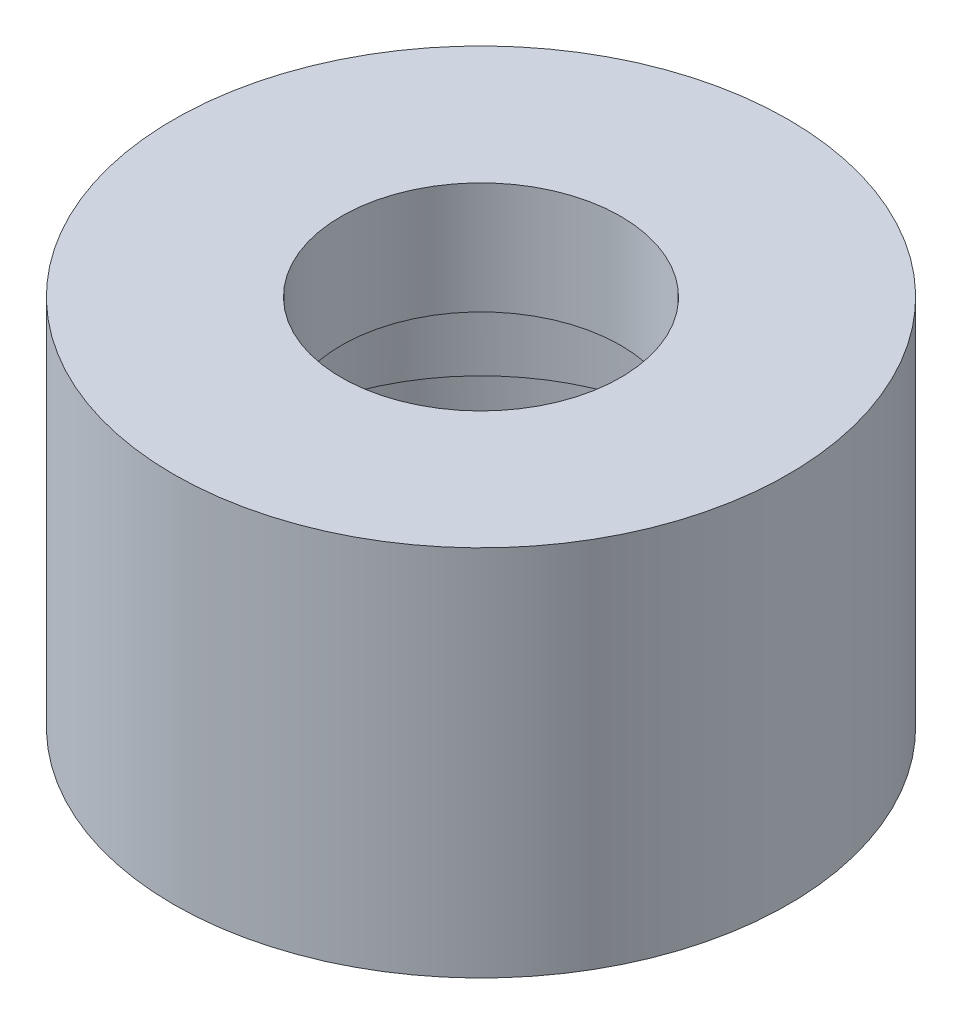
ISO-10303-21;
HEADER;
FILE_DESCRIPTION(('STEP AP214'),'2;1');
FILE_NAME('part.step','',(''),(''),'','','');
FILE_SCHEMA(('AUTOMOTIVE_DESIGN { 1 0 10303 214 1 1 1 1 }'));
ENDSEC;
DATA;
#1=APPLICATION_CONTEXT('core data for automotive mechanical design processes');
#2=APPLICATION_PROTOCOL_DEFINITION('international standard','automotive_design',2000,#1);
#3=PRODUCT_CONTEXT('',#1,'mechanical');
#4=PRODUCT('Part','Part','',(#3));
#5=PRODUCT_RELATED_PRODUCT_CATEGORY('part','',(#4));
#6=PRODUCT_DEFINITION_FORMATION('','',#4);
#7=PRODUCT_DEFINITION_CONTEXT('part definition',#1,'design');
#8=PRODUCT_DEFINITION('design','',#6,#7);
#9=PRODUCT_DEFINITION_SHAPE('','',#8);
#10=(LENGTH_UNIT() NAMED_UNIT(*) SI_UNIT(.MILLI.,.METRE.));
#11=(NAMED_UNIT(*) PLANE_ANGLE_UNIT() SI_UNIT($,.RADIAN.));
#12=(NAMED_UNIT(*) SI_UNIT($,.STERADIAN.) SOLID_ANGLE_UNIT());
#13=UNCERTAINTY_MEASURE_WITH_UNIT(LENGTH_MEASURE(1.E-05),#10,'distance_accuracy_value','');
#14=(GEOMETRIC_REPRESENTATION_CONTEXT(3) GLOBAL_UNCERTAINTY_ASSIGNED_CONTEXT((#13)) GLOBAL_UNIT_ASSIGNED_CONTEXT((#10,
#11,#12)) REPRESENTATION_CONTEXT('',''));
#15=CARTESIAN_POINT('',(0.,0.,0.));
#16=DIRECTION('',(0.,0.,1.));
#17=DIRECTION('',(1.,0.,0.));
#18=AXIS2_PLACEMENT_3D('',#15,#16,#17);
#19=CARTESIAN_POINT('',(0.,0.,0.));
#20=DIRECTION('',(0.,1.,0.));
#21=DIRECTION('',(0.,0.,1.));
#22=AXIS2_PLACEMENT_3D('',#19,#20,#21);
#23=PLANE('',#22);
#24=CARTESIAN_POINT('',(0.,0.,0.));
#25=DIRECTION('',(0.,1.,0.));
#26=DIRECTION('',(0.,0.,1.));
#27=AXIS2_PLACEMENT_3D('',#24,#25,#26);
#28=CIRCLE('',#27,16.5);
#29=CARTESIAN_POINT('',(0.,0.,16.5));
#30=VERTEX_POINT('',#29);
#31=EDGE_CURVE('E274',#30,#30,#28,.T.);
#32=ORIENTED_EDGE('',*,*,#31,.F.);
#33=EDGE_LOOP('',(#32));
#34=FACE_BOUND('',#33,.T.);
#35=DIRECTION('',(-0.500000000000004,0.,-0.866025403784436));
#36=VECTOR('',#35,1.);
#37=CARTESIAN_POINT('',(3.03108891324553,0.,-1.75000000000001));
#38=LINE('',#37,#36);
#39=CARTESIAN_POINT('',(-2.44613666180617,0.,-11.2368329805051));
#40=VERTEX_POINT('',#39);
#41=CARTESIAN_POINT('',(-3.44613666180618,0.,-12.968883788074));
#42=VERTEX_POINT('',#41);
#43=EDGE_CURVE('E228',#40,#42,#38,.T.);
#44=ORIENTED_EDGE('',*,*,#43,.F.);
#45=CARTESIAN_POINT('',(0.,0.,0.));
#46=DIRECTION('',(0.,-1.,0.));
#47=DIRECTION('',(0.,0.,-1.));
#48=AXIS2_PLACEMENT_3D('',#45,#46,#47);
#49=CIRCLE('',#48,11.5);
#50=CARTESIAN_POINT('',(-11.0588811407401,0.,3.15454401062719));
#51=VERTEX_POINT('',#50);
#52=EDGE_CURVE('E271',#51,#40,#49,.T.);
#53=ORIENTED_EDGE('',*,*,#52,.F.);
#54=DIRECTION('',(0.499999999999992,0.,-0.866025403784443));
#55=VECTOR('',#54,1.);
#56=CARTESIAN_POINT('',(-6.92820323027555,0.,-3.99999999999994));
#57=LINE('',#56,#55);
#58=CARTESIAN_POINT('',(-12.05888114074,0.,4.88659481819608));
#59=VERTEX_POINT('',#58);
#60=EDGE_CURVE('E225',#59,#51,#57,.T.);
#61=ORIENTED_EDGE('',*,*,#60,.F.);
#62=CARTESIAN_POINT('',(-0.999999999999984,0.,1.73205080756889));
#63=DIRECTION('',(0.,1.,0.));
#64=DIRECTION('',(0.,0.,1.));
#65=AXIS2_PLACEMENT_3D('',#62,#63,#64);
#66=CIRCLE('',#65,11.5);
#67=CARTESIAN_POINT('',(-9.50831448829711,0.,9.4688837880741));
#68=VERTEX_POINT('',#67);
#69=EDGE_CURVE('E45',#59,#68,#66,.T.);
#70=ORIENTED_EDGE('',*,*,#69,.T.);
#71=DIRECTION('',(-0.499999999999992,0.,0.866025403784443));
#72=VECTOR('',#71,1.);
#73=CARTESIAN_POINT('',(-3.03108891324555,0.,-1.74999999999997));
#74=LINE('',#73,#72);
#75=CARTESIAN_POINT('',(-8.50831448829713,0.,7.73683298050521));
#76=VERTEX_POINT('',#75);
#77=EDGE_CURVE('E205',#76,#68,#74,.T.);
#78=ORIENTED_EDGE('',*,*,#77,.F.);
#79=CARTESIAN_POINT('',(8.26135582092915,0.,8.));
#80=VERTEX_POINT('',#79);
#81=EDGE_CURVE('E268',#80,#76,#49,.T.);
#82=ORIENTED_EDGE('',*,*,#81,.F.);
#83=DIRECTION('',(-1.,0.,0.));
#84=VECTOR('',#83,1.);
#85=CARTESIAN_POINT('',(0.,0.,8.));
#86=LINE('',#85,#84);
#87=CARTESIAN_POINT('',(10.2613558209292,0.,8.));
#88=VERTEX_POINT('',#87);
#89=EDGE_CURVE('E234',#88,#80,#86,.T.);
#90=ORIENTED_EDGE('',*,*,#89,.F.);
#91=CARTESIAN_POINT('',(2.,0.,0.));
#92=DIRECTION('',(0.,1.,0.));
#93=DIRECTION('',(0.,0.,1.));
#94=AXIS2_PLACEMENT_3D('',#91,#92,#93);
#95=CIRCLE('',#94,11.5);
#96=CARTESIAN_POINT('',(12.9544511501033,0.,3.5));
#97=VERTEX_POINT('',#96);
#98=EDGE_CURVE('E291',#88,#97,#95,.T.);
#99=ORIENTED_EDGE('',*,*,#98,.T.);
#100=DIRECTION('',(1.,0.,0.));
#101=VECTOR('',#100,1.);
#102=CARTESIAN_POINT('',(0.,0.,3.5));
#103=LINE('',#102,#101);
#104=CARTESIAN_POINT('',(10.9544511501033,0.,3.5));
#105=VERTEX_POINT('',#104);
#106=EDGE_CURVE('E258',#105,#97,#103,.T.);
#107=ORIENTED_EDGE('',*,*,#106,.F.);
#108=CARTESIAN_POINT('',(2.79752531981089,0.,-11.1545440106271));
#109=VERTEX_POINT('',#108);
#110=EDGE_CURVE('E263',#109,#105,#49,.T.);
#111=ORIENTED_EDGE('',*,*,#110,.F.);
#112=DIRECTION('',(0.500000000000004,0.,0.866025403784436));
#113=VECTOR('',#112,1.);
#114=CARTESIAN_POINT('',(6.92820323027549,0.,-4.00000000000003));
#115=LINE('',#114,#113);
#116=CARTESIAN_POINT('',(1.79752531981088,0.,-12.886594818196));
#117=VERTEX_POINT('',#116);
#118=EDGE_CURVE('E60',#117,#109,#115,.T.);
#119=ORIENTED_EDGE('',*,*,#118,.F.);
#120=CARTESIAN_POINT('',(-1.00000000000001,0.,-1.73205080756887));
#121=DIRECTION('',(0.,1.,0.));
#122=DIRECTION('',(0.,0.,1.));
#123=AXIS2_PLACEMENT_3D('',#120,#121,#122);
#124=CIRCLE('',#123,11.5);
#125=EDGE_CURVE('E12',#117,#42,#124,.T.);
#126=ORIENTED_EDGE('',*,*,#125,.T.);
#127=EDGE_LOOP('',(#44,#53,#61,#70,#78,#82,#90,#99,#107,#111,#119,#126));
#128=FACE_BOUND('',#127,.T.);
#129=ADVANCED_FACE('F37',(#34,#128),#23,.F.);
#130=CARTESIAN_POINT('',(0.,14.,0.));
#131=DIRECTION('',(0.,-1.,0.));
#132=DIRECTION('',(0.,0.,-1.));
#133=AXIS2_PLACEMENT_3D('',#130,#131,#132);
#134=CYLINDRICAL_SURFACE('',#133,11.5);
#135=CARTESIAN_POINT('',(0.,14.,0.));
#136=DIRECTION('',(0.,-1.,0.));
#137=DIRECTION('',(0.,0.,-1.));
#138=AXIS2_PLACEMENT_3D('',#135,#136,#137);
#139=CIRCLE('',#138,11.5);
#140=CARTESIAN_POINT('',(0.,14.,-11.5));
#141=VERTEX_POINT('',#140);
#142=EDGE_CURVE('E264',#141,#141,#139,.T.);
#143=ORIENTED_EDGE('',*,*,#142,.F.);
#144=EDGE_LOOP('',(#143));
#145=FACE_BOUND('',#144,.T.);
#146=DIRECTION('',(0.,-1.,0.));
#147=VECTOR('',#146,1.);
#148=CARTESIAN_POINT('',(-2.44613666180617,14.,-11.2368329805051));
#149=LINE('',#148,#147);
#150=CARTESIAN_POINT('',(-2.44613666180617,4.1,-11.2368329805051));
#151=VERTEX_POINT('',#150);
#152=EDGE_CURVE('E309',#151,#40,#149,.T.);
#153=ORIENTED_EDGE('',*,*,#152,.F.);
#154=CARTESIAN_POINT('',(0.,4.1,0.));
#155=DIRECTION('',(0.,1.,0.));
#156=DIRECTION('',(-1.,0.,0.));
#157=AXIS2_PLACEMENT_3D('',#154,#155,#156);
#158=CIRCLE('',#157,11.5);
#159=CARTESIAN_POINT('',(-11.0588811407401,4.1,-3.15454401062704));
#160=VERTEX_POINT('',#159);
#161=EDGE_CURVE('E302',#160,#151,#158,.F.);
#162=ORIENTED_EDGE('',*,*,#161,.F.);
#163=DIRECTION('',(0.,-1.,0.));
#164=VECTOR('',#163,1.);
#165=CARTESIAN_POINT('',(-11.0588811407401,14.,-3.15454401062704));
#166=LINE('',#165,#164);
#167=CARTESIAN_POINT('',(-11.0588811407401,8.2,-3.15454401062704));
#168=VERTEX_POINT('',#167);
#169=EDGE_CURVE('E307',#168,#160,#166,.T.);
#170=ORIENTED_EDGE('',*,*,#169,.F.);
#171=CARTESIAN_POINT('',(0.,8.2,0.));
#172=DIRECTION('',(0.,-1.,0.));
#173=DIRECTION('',(1.,0.,0.));
#174=AXIS2_PLACEMENT_3D('',#171,#172,#173);
#175=CIRCLE('',#174,11.5);
#176=CARTESIAN_POINT('',(2.79752531981089,8.2,-11.1545440106271));
#177=VERTEX_POINT('',#176);
#178=EDGE_CURVE('E299',#177,#168,#175,.F.);
#179=ORIENTED_EDGE('',*,*,#178,.F.);
#180=DIRECTION('',(0.,-1.,0.));
#181=VECTOR('',#180,1.);
#182=CARTESIAN_POINT('',(2.79752531981089,14.,-11.1545440106271));
#183=LINE('',#182,#181);
#184=EDGE_CURVE('E305',#109,#177,#183,.F.);
#185=ORIENTED_EDGE('',*,*,#184,.F.);
#186=ORIENTED_EDGE('',*,*,#110,.T.);
#187=DIRECTION('',(0.,-1.,0.));
#188=VECTOR('',#187,1.);
#189=CARTESIAN_POINT('',(10.9544511501033,14.,3.5));
#190=LINE('',#189,#188);
#191=CARTESIAN_POINT('',(10.9544511501033,4.1,3.5));
#192=VERTEX_POINT('',#191);
#193=EDGE_CURVE('E288',#192,#105,#190,.T.);
#194=ORIENTED_EDGE('',*,*,#193,.F.);
#195=CARTESIAN_POINT('',(0.,4.1,0.));
#196=DIRECTION('',(0.,1.,0.));
#197=DIRECTION('',(0.,0.,1.));
#198=AXIS2_PLACEMENT_3D('',#195,#196,#197);
#199=CIRCLE('',#198,11.5);
#200=CARTESIAN_POINT('',(8.26135582092915,4.1,-8.));
#201=VERTEX_POINT('',#200);
#202=EDGE_CURVE('E286',#201,#192,#199,.F.);
#203=ORIENTED_EDGE('',*,*,#202,.F.);
#204=DIRECTION('',(0.,-1.,0.));
#205=VECTOR('',#204,1.);
#206=CARTESIAN_POINT('',(8.26135582092915,14.,-8.));
#207=LINE('',#206,#205);
#208=CARTESIAN_POINT('',(8.26135582092915,8.2,-8.));
#209=VERTEX_POINT('',#208);
#210=EDGE_CURVE('E284',#209,#201,#207,.T.);
#211=ORIENTED_EDGE('',*,*,#210,.F.);
#212=CARTESIAN_POINT('',(0.,8.2,0.));
#213=DIRECTION('',(0.,-1.,0.));
#214=DIRECTION('',(0.,0.,-1.));
#215=AXIS2_PLACEMENT_3D('',#212,#213,#214);
#216=CIRCLE('',#215,11.5);
#217=CARTESIAN_POINT('',(8.26135582092915,8.2,8.));
#218=VERTEX_POINT('',#217);
#219=EDGE_CURVE('E282',#218,#209,#216,.F.);
#220=ORIENTED_EDGE('',*,*,#219,.F.);
#221=DIRECTION('',(0.,-1.,0.));
#222=VECTOR('',#221,1.);
#223=CARTESIAN_POINT('',(8.26135582092915,14.,8.));
#224=LINE('',#223,#222);
#225=EDGE_CURVE('E278',#80,#218,#224,.F.);
#226=ORIENTED_EDGE('',*,*,#225,.F.);
#227=ORIENTED_EDGE('',*,*,#81,.T.);
#228=DIRECTION('',(0.,-1.,0.));
#229=VECTOR('',#228,1.);
#230=CARTESIAN_POINT('',(-8.50831448829713,14.,7.73683298050521));
#231=LINE('',#230,#229);
#232=CARTESIAN_POINT('',(-8.50831448829713,4.1,7.73683298050522));
#233=VERTEX_POINT('',#232);
#234=EDGE_CURVE('E301',#233,#76,#231,.T.);
#235=ORIENTED_EDGE('',*,*,#234,.F.);
#236=CARTESIAN_POINT('',(2.79752531981103,4.1,11.1545440106271));
#237=VERTEX_POINT('',#236);
#238=EDGE_CURVE('E298',#237,#233,#158,.F.);
#239=ORIENTED_EDGE('',*,*,#238,.F.);
#240=DIRECTION('',(0.,-1.,0.));
#241=VECTOR('',#240,1.);
#242=CARTESIAN_POINT('',(2.79752531981103,14.,11.1545440106271));
#243=LINE('',#242,#241);
#244=CARTESIAN_POINT('',(2.79752531981103,8.2,11.1545440106271));
#245=VERTEX_POINT('',#244);
#246=EDGE_CURVE('E294',#245,#237,#243,.T.);
#247=ORIENTED_EDGE('',*,*,#246,.F.);
#248=CARTESIAN_POINT('',(-11.0588811407401,8.2,3.15454401062719));
#249=VERTEX_POINT('',#248);
#250=EDGE_CURVE('E296',#249,#245,#175,.F.);
#251=ORIENTED_EDGE('',*,*,#250,.F.);
#252=DIRECTION('',(0.,-1.,0.));
#253=VECTOR('',#252,1.);
#254=CARTESIAN_POINT('',(-11.0588811407401,14.,3.15454401062719));
#255=LINE('',#254,#253);
#256=EDGE_CURVE('E170',#51,#249,#255,.F.);
#257=ORIENTED_EDGE('',*,*,#256,.F.);
#258=ORIENTED_EDGE('',*,*,#52,.T.);
#259=EDGE_LOOP('',(#153,#162,#170,#179,#185,#186,#194,#203,#211,#220,#226,#227,#235,#239,#247,
#251,#257,#258));
#260=FACE_BOUND('',#259,.T.);
#261=ADVANCED_FACE('F318',(#145,#260),#134,.F.);
#262=CARTESIAN_POINT('',(0.,20.,0.));
#263=DIRECTION('',(0.,-1.,0.));
#264=DIRECTION('',(0.,0.,-1.));
#265=AXIS2_PLACEMENT_3D('',#262,#263,#264);
#266=CYLINDRICAL_SURFACE('',#265,7.5);
#267=CARTESIAN_POINT('',(0.,20.,0.));
#268=DIRECTION('',(0.,-1.,0.));
#269=DIRECTION('',(0.,0.,-1.));
#270=AXIS2_PLACEMENT_3D('',#267,#268,#269);
#271=CIRCLE('',#270,7.5);
#272=CARTESIAN_POINT('',(0.,20.,-7.5));
#273=VERTEX_POINT('',#272);
#274=EDGE_CURVE('E267',#273,#273,#271,.T.);
#275=ORIENTED_EDGE('',*,*,#274,.F.);
#276=EDGE_LOOP('',(#275));
#277=FACE_BOUND('',#276,.T.);
#278=CARTESIAN_POINT('',(0.,14.,0.));
#279=DIRECTION('',(0.,-1.,0.));
#280=DIRECTION('',(0.,0.,-1.));
#281=AXIS2_PLACEMENT_3D('',#278,#279,#280);
#282=CIRCLE('',#281,7.5);
#283=CARTESIAN_POINT('',(0.,14.,-7.5));
#284=VERTEX_POINT('',#283);
#285=EDGE_CURVE('E260',#284,#284,#282,.T.);
#286=ORIENTED_EDGE('',*,*,#285,.T.);
#287=EDGE_LOOP('',(#286));
#288=FACE_BOUND('',#287,.T.);
#289=ADVANCED_FACE('F391',(#277,#288),#266,.F.);
#290=CARTESIAN_POINT('',(0.,20.,0.));
#291=DIRECTION('',(0.,-1.,0.));
#292=DIRECTION('',(0.,0.,-1.));
#293=AXIS2_PLACEMENT_3D('',#290,#291,#292);
#294=CYLINDRICAL_SURFACE('',#293,16.5);
#295=CARTESIAN_POINT('',(0.,20.,0.));
#296=DIRECTION('',(0.,1.,0.));
#297=DIRECTION('',(0.,0.,1.));
#298=AXIS2_PLACEMENT_3D('',#295,#296,#297);
#299=CIRCLE('',#298,16.5);
#300=CARTESIAN_POINT('',(0.,20.,16.5));
#301=VERTEX_POINT('',#300);
#302=EDGE_CURVE('E275',#301,#301,#299,.T.);
#303=ORIENTED_EDGE('',*,*,#302,.F.);
#304=EDGE_LOOP('',(#303));
#305=FACE_BOUND('',#304,.T.);
#306=ORIENTED_EDGE('',*,*,#31,.T.);
#307=EDGE_LOOP('',(#306));
#308=FACE_BOUND('',#307,.T.);
#309=ADVANCED_FACE('F39',(#305,#308),#294,.T.);
#310=CARTESIAN_POINT('',(0.,20.,0.));
#311=DIRECTION('',(0.,1.,0.));
#312=DIRECTION('',(0.,0.,1.));
#313=AXIS2_PLACEMENT_3D('',#310,#311,#312);
#314=PLANE('',#313);
#315=ORIENTED_EDGE('',*,*,#274,.T.);
#316=EDGE_LOOP('',(#315));
#317=FACE_BOUND('',#316,.T.);
#318=ORIENTED_EDGE('',*,*,#302,.T.);
#319=EDGE_LOOP('',(#318));
#320=FACE_BOUND('',#319,.T.);
#321=ADVANCED_FACE('F396',(#317,#320),#314,.T.);
#322=CARTESIAN_POINT('',(0.,14.,0.));
#323=DIRECTION('',(0.,-1.,0.));
#324=DIRECTION('',(0.,0.,-1.));
#325=AXIS2_PLACEMENT_3D('',#322,#323,#324);
#326=PLANE('',#325);
#327=ORIENTED_EDGE('',*,*,#285,.F.);
#328=EDGE_LOOP('',(#327));
#329=FACE_BOUND('',#328,.T.);
#330=ORIENTED_EDGE('',*,*,#142,.T.);
#331=EDGE_LOOP('',(#330));
#332=FACE_BOUND('',#331,.T.);
#333=ADVANCED_FACE('F399',(#329,#332),#326,.T.);
#334=CARTESIAN_POINT('',(2.,14.,0.));
#335=DIRECTION('',(0.,-1.,0.));
#336=DIRECTION('',(0.,0.,-1.));
#337=AXIS2_PLACEMENT_3D('',#334,#335,#336);
#338=CYLINDRICAL_SURFACE('',#337,11.5);
#339=DIRECTION('',(0.,-1.,0.));
#340=VECTOR('',#339,1.);
#341=CARTESIAN_POINT('',(10.2613558209292,14.,8.));
#342=LINE('',#341,#340);
#343=CARTESIAN_POINT('',(10.2613558209292,8.2,8.));
#344=VERTEX_POINT('',#343);
#345=EDGE_CURVE('E243',#344,#88,#342,.T.);
#346=ORIENTED_EDGE('',*,*,#345,.F.);
#347=CARTESIAN_POINT('',(2.,8.2,0.));
#348=DIRECTION('',(0.,-1.,0.));
#349=DIRECTION('',(0.,0.,-1.));
#350=AXIS2_PLACEMENT_3D('',#347,#348,#349);
#351=CIRCLE('',#350,11.5);
#352=CARTESIAN_POINT('',(10.2613558209292,8.2,-8.));
#353=VERTEX_POINT('',#352);
#354=EDGE_CURVE('E231',#353,#344,#351,.T.);
#355=ORIENTED_EDGE('',*,*,#354,.F.);
#356=DIRECTION('',(0.,-1.,0.));
#357=VECTOR('',#356,1.);
#358=CARTESIAN_POINT('',(10.2613558209292,14.,-8.));
#359=LINE('',#358,#357);
#360=CARTESIAN_POINT('',(10.2613558209292,4.1,-8.));
#361=VERTEX_POINT('',#360);
#362=EDGE_CURVE('E235',#361,#353,#359,.F.);
#363=ORIENTED_EDGE('',*,*,#362,.F.);
#364=CARTESIAN_POINT('',(2.,4.1,0.));
#365=DIRECTION('',(0.,1.,0.));
#366=DIRECTION('',(0.,0.,1.));
#367=AXIS2_PLACEMENT_3D('',#364,#365,#366);
#368=CIRCLE('',#367,11.5);
#369=CARTESIAN_POINT('',(12.9544511501033,4.1,3.5));
#370=VERTEX_POINT('',#369);
#371=EDGE_CURVE('E238',#370,#361,#368,.T.);
#372=ORIENTED_EDGE('',*,*,#371,.F.);
#373=DIRECTION('',(0.,-1.,0.));
#374=VECTOR('',#373,1.);
#375=CARTESIAN_POINT('',(12.9544511501033,14.,3.5));
#376=LINE('',#375,#374);
#377=EDGE_CURVE('E241',#97,#370,#376,.F.);
#378=ORIENTED_EDGE('',*,*,#377,.F.);
#379=ORIENTED_EDGE('',*,*,#98,.F.);
#380=EDGE_LOOP('',(#346,#355,#363,#372,#378,#379));
#381=FACE_BOUND('',#380,.T.);
#382=ADVANCED_FACE('F338',(#381),#338,.F.);
#383=CARTESIAN_POINT('',(20.501,4.1,3.5));
#384=DIRECTION('',(0.,0.,1.));
#385=DIRECTION('',(0.,-1.,0.));
#386=AXIS2_PLACEMENT_3D('',#383,#384,#385);
#387=PLANE('',#386);
#388=ORIENTED_EDGE('',*,*,#106,.T.);
#389=ORIENTED_EDGE('',*,*,#377,.T.);
#390=DIRECTION('',(-1.,0.,0.));
#391=VECTOR('',#390,1.);
#392=CARTESIAN_POINT('',(20.501,4.1,3.5));
#393=LINE('',#392,#391);
#394=EDGE_CURVE('E230',#370,#192,#393,.T.);
#395=ORIENTED_EDGE('',*,*,#394,.T.);
#396=ORIENTED_EDGE('',*,*,#193,.T.);
#397=EDGE_LOOP('',(#388,#389,#395,#396));
#398=FACE_BOUND('',#397,.T.);
#399=ADVANCED_FACE('F354',(#398),#387,.T.);
#400=CARTESIAN_POINT('',(20.501,4.1,-8.));
#401=DIRECTION('',(0.,1.,0.));
#402=DIRECTION('',(0.,0.,1.));
#403=AXIS2_PLACEMENT_3D('',#400,#401,#402);
#404=PLANE('',#403);
#405=ORIENTED_EDGE('',*,*,#202,.T.);
#406=ORIENTED_EDGE('',*,*,#394,.F.);
#407=ORIENTED_EDGE('',*,*,#371,.T.);
#408=DIRECTION('',(-1.,0.,0.));
#409=VECTOR('',#408,1.);
#410=CARTESIAN_POINT('',(20.501,4.1,-8.));
#411=LINE('',#410,#409);
#412=EDGE_CURVE('E249',#361,#201,#411,.T.);
#413=ORIENTED_EDGE('',*,*,#412,.T.);
#414=EDGE_LOOP('',(#405,#406,#407,#413));
#415=FACE_BOUND('',#414,.T.);
#416=ADVANCED_FACE('F350',(#415),#404,.T.);
#417=CARTESIAN_POINT('',(20.501,8.2,-8.));
#418=DIRECTION('',(0.,0.,1.));
#419=DIRECTION('',(1.,0.,0.));
#420=AXIS2_PLACEMENT_3D('',#417,#418,#419);
#421=PLANE('',#420);
#422=ORIENTED_EDGE('',*,*,#210,.T.);
#423=ORIENTED_EDGE('',*,*,#412,.F.);
#424=ORIENTED_EDGE('',*,*,#362,.T.);
#425=DIRECTION('',(-1.,0.,0.));
#426=VECTOR('',#425,1.);
#427=CARTESIAN_POINT('',(20.501,8.2,-8.));
#428=LINE('',#427,#426);
#429=EDGE_CURVE('E252',#353,#209,#428,.T.);
#430=ORIENTED_EDGE('',*,*,#429,.T.);
#431=EDGE_LOOP('',(#422,#423,#424,#430));
#432=FACE_BOUND('',#431,.T.);
#433=ADVANCED_FACE('F346',(#432),#421,.T.);
#434=CARTESIAN_POINT('',(20.501,8.2,8.));
#435=DIRECTION('',(0.,-1.,0.));
#436=DIRECTION('',(0.,0.,-1.));
#437=AXIS2_PLACEMENT_3D('',#434,#435,#436);
#438=PLANE('',#437);
#439=ORIENTED_EDGE('',*,*,#219,.T.);
#440=ORIENTED_EDGE('',*,*,#429,.F.);
#441=ORIENTED_EDGE('',*,*,#354,.T.);
#442=DIRECTION('',(-1.,0.,0.));
#443=VECTOR('',#442,1.);
#444=CARTESIAN_POINT('',(20.501,8.2,8.));
#445=LINE('',#444,#443);
#446=EDGE_CURVE('E246',#344,#218,#445,.T.);
#447=ORIENTED_EDGE('',*,*,#446,.T.);
#448=EDGE_LOOP('',(#439,#440,#441,#447));
#449=FACE_BOUND('',#448,.T.);
#450=ADVANCED_FACE('F342',(#449),#438,.T.);
#451=CARTESIAN_POINT('',(20.501,-0.446060187776345,8.));
#452=DIRECTION('',(0.,0.,-1.));
#453=DIRECTION('',(-1.,0.,0.));
#454=AXIS2_PLACEMENT_3D('',#451,#452,#453);
#455=PLANE('',#454);
#456=ORIENTED_EDGE('',*,*,#89,.T.);
#457=ORIENTED_EDGE('',*,*,#225,.T.);
#458=ORIENTED_EDGE('',*,*,#446,.F.);
#459=ORIENTED_EDGE('',*,*,#345,.T.);
#460=EDGE_LOOP('',(#456,#457,#458,#459));
#461=FACE_BOUND('',#460,.T.);
#462=ADVANCED_FACE('F335',(#461),#455,.T.);
#463=CARTESIAN_POINT('',(-16.6675069109533,4.1,21.8689688052769));
#464=DIRECTION('',(-0.866025403784443,0.,-0.499999999999992));
#465=DIRECTION('',(-0.499999999999992,0.,0.866025403784443));
#466=AXIS2_PLACEMENT_3D('',#463,#464,#465);
#467=PLANE('',#466);
#468=ORIENTED_EDGE('',*,*,#77,.T.);
#469=DIRECTION('',(0.,-1.,0.));
#470=VECTOR('',#469,1.);
#471=CARTESIAN_POINT('',(-9.50831448829711,14.,9.4688837880741));
#472=LINE('',#471,#470);
#473=CARTESIAN_POINT('',(-9.50831448829711,4.1,9.4688837880741));
#474=VERTEX_POINT('',#473);
#475=EDGE_CURVE('E180',#68,#474,#472,.F.);
#476=ORIENTED_EDGE('',*,*,#475,.T.);
#477=DIRECTION('',(0.499999999999992,0.,-0.866025403784443));
#478=VECTOR('',#477,1.);
#479=CARTESIAN_POINT('',(-16.6675069109533,4.1,21.8689688052769));
#480=LINE('',#479,#478);
#481=EDGE_CURVE('E195',#474,#233,#480,.T.);
#482=ORIENTED_EDGE('',*,*,#481,.T.);
#483=ORIENTED_EDGE('',*,*,#234,.T.);
#484=EDGE_LOOP('',(#468,#476,#482,#483));
#485=FACE_BOUND('',#484,.T.);
#486=ADVANCED_FACE('F329',(#485),#467,.T.);
#487=CARTESIAN_POINT('',(-6.70821476743216,8.2,27.6189688052768));
#488=DIRECTION('',(-0.866025403784443,0.,-0.499999999999992));
#489=DIRECTION('',(-0.499999999999992,0.,0.866025403784443));
#490=AXIS2_PLACEMENT_3D('',#487,#488,#489);
#491=PLANE('',#490);
#492=ORIENTED_EDGE('',*,*,#246,.T.);
#493=DIRECTION('',(0.499999999999992,0.,-0.866025403784443));
#494=VECTOR('',#493,1.);
#495=CARTESIAN_POINT('',(-6.70821476743216,4.1,27.6189688052768));
#496=LINE('',#495,#494);
#497=CARTESIAN_POINT('',(1.79752531981105,4.1,12.886594818196));
#498=VERTEX_POINT('',#497);
#499=EDGE_CURVE('E198',#498,#237,#496,.T.);
#500=ORIENTED_EDGE('',*,*,#499,.F.);
#501=DIRECTION('',(0.,-1.,0.));
#502=VECTOR('',#501,1.);
#503=CARTESIAN_POINT('',(1.79752531981105,14.,12.886594818196));
#504=LINE('',#503,#502);
#505=CARTESIAN_POINT('',(1.79752531981105,8.2,12.886594818196));
#506=VERTEX_POINT('',#505);
#507=EDGE_CURVE('E184',#498,#506,#504,.F.);
#508=ORIENTED_EDGE('',*,*,#507,.T.);
#509=DIRECTION('',(0.499999999999992,0.,-0.866025403784443));
#510=VECTOR('',#509,1.);
#511=CARTESIAN_POINT('',(-6.70821476743216,8.2,27.6189688052768));
#512=LINE('',#511,#510);
#513=EDGE_CURVE('E52',#506,#245,#512,.T.);
#514=ORIENTED_EDGE('',*,*,#513,.T.);
#515=EDGE_LOOP('',(#492,#500,#508,#514));
#516=FACE_BOUND('',#515,.T.);
#517=ADVANCED_FACE('F323',(#516),#491,.T.);
#518=CARTESIAN_POINT('',(-20.5646212279832,-0.446060187776345,19.618968805277));
#519=DIRECTION('',(0.866025403784443,0.,0.499999999999992));
#520=DIRECTION('',(0.499999999999992,0.,-0.866025403784443));
#521=AXIS2_PLACEMENT_3D('',#518,#519,#520);
#522=PLANE('',#521);
#523=ORIENTED_EDGE('',*,*,#60,.T.);
#524=ORIENTED_EDGE('',*,*,#256,.T.);
#525=DIRECTION('',(0.499999999999992,0.,-0.866025403784443));
#526=VECTOR('',#525,1.);
#527=CARTESIAN_POINT('',(-20.5646212279832,8.2,19.618968805277));
#528=LINE('',#527,#526);
#529=CARTESIAN_POINT('',(-12.05888114074,8.2,4.88659481819608));
#530=VERTEX_POINT('',#529);
#531=EDGE_CURVE('E164',#530,#249,#528,.T.);
#532=ORIENTED_EDGE('',*,*,#531,.F.);
#533=DIRECTION('',(0.,-1.,0.));
#534=VECTOR('',#533,1.);
#535=CARTESIAN_POINT('',(-12.05888114074,14.,4.88659481819608));
#536=LINE('',#535,#534);
#537=EDGE_CURVE('E167',#530,#59,#536,.T.);
#538=ORIENTED_EDGE('',*,*,#537,.T.);
#539=EDGE_LOOP('',(#523,#524,#532,#538));
#540=FACE_BOUND('',#539,.T.);
#541=ADVANCED_FACE('F166',(#540),#522,.T.);
#542=CARTESIAN_POINT('',(-6.70821476743259,8.2,-27.6189688052768));
#543=DIRECTION('',(0.,-1.,0.));
#544=DIRECTION('',(1.,0.,0.));
#545=AXIS2_PLACEMENT_3D('',#542,#543,#544);
#546=PLANE('',#545);
#547=ORIENTED_EDGE('',*,*,#250,.T.);
#548=ORIENTED_EDGE('',*,*,#513,.F.);
#549=CARTESIAN_POINT('',(-0.999999999999984,8.2,1.73205080756889));
#550=DIRECTION('',(0.,-1.,0.));
#551=DIRECTION('',(1.,0.,0.));
#552=AXIS2_PLACEMENT_3D('',#549,#550,#551);
#553=CIRCLE('',#552,11.5);
#554=EDGE_CURVE('E177',#506,#530,#553,.T.);
#555=ORIENTED_EDGE('',*,*,#554,.T.);
#556=ORIENTED_EDGE('',*,*,#531,.T.);
#557=EDGE_LOOP('',(#547,#548,#555,#556));
#558=FACE_BOUND('',#557,.T.);
#559=ADVANCED_FACE('F182',(#558),#546,.T.);
#560=CARTESIAN_POINT('',(-20.5646212279836,4.1,-19.6189688052768));
#561=DIRECTION('',(0.,1.,0.));
#562=DIRECTION('',(-1.,0.,0.));
#563=AXIS2_PLACEMENT_3D('',#560,#561,#562);
#564=PLANE('',#563);
#565=ORIENTED_EDGE('',*,*,#238,.T.);
#566=ORIENTED_EDGE('',*,*,#481,.F.);
#567=CARTESIAN_POINT('',(-0.999999999999984,4.1,1.73205080756889));
#568=DIRECTION('',(0.,1.,0.));
#569=DIRECTION('',(-1.,0.,0.));
#570=AXIS2_PLACEMENT_3D('',#567,#568,#569);
#571=CIRCLE('',#570,11.5);
#572=EDGE_CURVE('E189',#474,#498,#571,.T.);
#573=ORIENTED_EDGE('',*,*,#572,.T.);
#574=ORIENTED_EDGE('',*,*,#499,.T.);
#575=EDGE_LOOP('',(#565,#566,#573,#574));
#576=FACE_BOUND('',#575,.T.);
#577=ADVANCED_FACE('F325',(#576),#564,.T.);
#578=CARTESIAN_POINT('',(-0.999999999999984,14.,1.73205080756889));
#579=DIRECTION('',(0.,-1.,0.));
#580=DIRECTION('',(0.,0.,-1.));
#581=AXIS2_PLACEMENT_3D('',#578,#579,#580);
#582=CYLINDRICAL_SURFACE('',#581,11.5);
#583=ORIENTED_EDGE('',*,*,#537,.F.);
#584=ORIENTED_EDGE('',*,*,#554,.F.);
#585=ORIENTED_EDGE('',*,*,#507,.F.);
#586=ORIENTED_EDGE('',*,*,#572,.F.);
#587=ORIENTED_EDGE('',*,*,#475,.F.);
#588=ORIENTED_EDGE('',*,*,#69,.F.);
#589=EDGE_LOOP('',(#583,#584,#585,#586,#587,#588));
#590=FACE_BOUND('',#589,.T.);
#591=ADVANCED_FACE('F176',(#590),#582,.F.);
#592=CARTESIAN_POINT('',(-1.00000000000001,14.,-1.73205080756887));
#593=DIRECTION('',(0.,-1.,0.));
#594=DIRECTION('',(0.,0.,-1.));
#595=AXIS2_PLACEMENT_3D('',#592,#593,#594);
#596=CYLINDRICAL_SURFACE('',#595,11.5);
#597=DIRECTION('',(0.,-1.,0.));
#598=VECTOR('',#597,1.);
#599=CARTESIAN_POINT('',(1.79752531981088,14.,-12.886594818196));
#600=LINE('',#599,#598);
#601=CARTESIAN_POINT('',(1.79752531981088,8.2,-12.886594818196));
#602=VERTEX_POINT('',#601);
#603=EDGE_CURVE('E214',#602,#117,#600,.T.);
#604=ORIENTED_EDGE('',*,*,#603,.F.);
#605=CARTESIAN_POINT('',(-1.00000000000001,8.2,-1.73205080756887));
#606=DIRECTION('',(0.,-1.,0.));
#607=DIRECTION('',(1.,0.,0.));
#608=AXIS2_PLACEMENT_3D('',#605,#606,#607);
#609=CIRCLE('',#608,11.5);
#610=CARTESIAN_POINT('',(-12.0588811407401,8.2,-4.88659481819591));
#611=VERTEX_POINT('',#610);
#612=EDGE_CURVE('E202',#611,#602,#609,.T.);
#613=ORIENTED_EDGE('',*,*,#612,.F.);
#614=DIRECTION('',(0.,-1.,0.));
#615=VECTOR('',#614,1.);
#616=CARTESIAN_POINT('',(-12.0588811407401,14.,-4.88659481819591));
#617=LINE('',#616,#615);
#618=CARTESIAN_POINT('',(-12.0588811407401,4.1,-4.88659481819591));
#619=VERTEX_POINT('',#618);
#620=EDGE_CURVE('E206',#619,#611,#617,.F.);
#621=ORIENTED_EDGE('',*,*,#620,.F.);
#622=CARTESIAN_POINT('',(-1.00000000000001,4.1,-1.73205080756887));
#623=DIRECTION('',(0.,1.,0.));
#624=DIRECTION('',(-1.,0.,0.));
#625=AXIS2_PLACEMENT_3D('',#622,#623,#624);
#626=CIRCLE('',#625,11.5);
#627=CARTESIAN_POINT('',(-3.44613666180618,4.1,-12.968883788074));
#628=VERTEX_POINT('',#627);
#629=EDGE_CURVE('E209',#628,#619,#626,.T.);
#630=ORIENTED_EDGE('',*,*,#629,.F.);
#631=DIRECTION('',(0.,-1.,0.));
#632=VECTOR('',#631,1.);
#633=CARTESIAN_POINT('',(-3.44613666180618,14.,-12.968883788074));
#634=LINE('',#633,#632);
#635=EDGE_CURVE('E212',#42,#628,#634,.F.);
#636=ORIENTED_EDGE('',*,*,#635,.F.);
#637=ORIENTED_EDGE('',*,*,#125,.F.);
#638=EDGE_LOOP('',(#604,#613,#621,#630,#636,#637));
#639=FACE_BOUND('',#638,.T.);
#640=ADVANCED_FACE('F360',(#639),#596,.F.);
#641=ORIENTED_EDGE('',*,*,#161,.T.);
#642=DIRECTION('',(0.500000000000004,0.,0.866025403784436));
#643=VECTOR('',#642,1.);
#644=CARTESIAN_POINT('',(-10.6053290844626,4.1,-25.3689688052768));
#645=LINE('',#644,#643);
#646=EDGE_CURVE('E183',#628,#151,#645,.T.);
#647=ORIENTED_EDGE('',*,*,#646,.F.);
#648=ORIENTED_EDGE('',*,*,#629,.T.);
#649=DIRECTION('',(0.500000000000004,0.,0.866025403784436));
#650=VECTOR('',#649,1.);
#651=CARTESIAN_POINT('',(-20.5646212279836,4.1,-19.6189688052768));
#652=LINE('',#651,#650);
#653=EDGE_CURVE('E187',#619,#160,#652,.T.);
#654=ORIENTED_EDGE('',*,*,#653,.T.);
#655=EDGE_LOOP('',(#641,#647,#648,#654));
#656=FACE_BOUND('',#655,.T.);
#657=ADVANCED_FACE('F372',(#656),#564,.T.);
#658=CARTESIAN_POINT('',(-20.5646212279836,8.2,-19.6189688052768));
#659=DIRECTION('',(0.866025403784436,0.,-0.500000000000004));
#660=DIRECTION('',(-0.500000000000004,0.,-0.866025403784436));
#661=AXIS2_PLACEMENT_3D('',#658,#659,#660);
#662=PLANE('',#661);
#663=ORIENTED_EDGE('',*,*,#169,.T.);
#664=ORIENTED_EDGE('',*,*,#653,.F.);
#665=ORIENTED_EDGE('',*,*,#620,.T.);
#666=DIRECTION('',(0.500000000000004,0.,0.866025403784436));
#667=VECTOR('',#666,1.);
#668=CARTESIAN_POINT('',(-20.5646212279836,8.2,-19.6189688052768));
#669=LINE('',#668,#667);
#670=EDGE_CURVE('E219',#611,#168,#669,.T.);
#671=ORIENTED_EDGE('',*,*,#670,.T.);
#672=EDGE_LOOP('',(#663,#664,#665,#671));
#673=FACE_BOUND('',#672,.T.);
#674=ADVANCED_FACE('F370',(#673),#662,.T.);
#675=CARTESIAN_POINT('',(-10.6053290844626,4.1,-25.3689688052768));
#676=DIRECTION('',(0.866025403784436,0.,-0.500000000000004));
#677=DIRECTION('',(-0.500000000000004,0.,-0.866025403784436));
#678=AXIS2_PLACEMENT_3D('',#675,#676,#677);
#679=PLANE('',#678);
#680=ORIENTED_EDGE('',*,*,#43,.T.);
#681=ORIENTED_EDGE('',*,*,#635,.T.);
#682=ORIENTED_EDGE('',*,*,#646,.T.);
#683=ORIENTED_EDGE('',*,*,#152,.T.);
#684=EDGE_LOOP('',(#680,#681,#682,#683));
#685=FACE_BOUND('',#684,.T.);
#686=ADVANCED_FACE('F375',(#685),#679,.T.);
#687=ORIENTED_EDGE('',*,*,#178,.T.);
#688=ORIENTED_EDGE('',*,*,#670,.F.);
#689=ORIENTED_EDGE('',*,*,#612,.T.);
#690=DIRECTION('',(0.500000000000004,0.,0.866025403784436));
#691=VECTOR('',#690,1.);
#692=CARTESIAN_POINT('',(-6.70821476743259,8.2,-27.6189688052768));
#693=LINE('',#692,#691);
#694=EDGE_CURVE('E215',#602,#177,#693,.T.);
#695=ORIENTED_EDGE('',*,*,#694,.T.);
#696=EDGE_LOOP('',(#687,#688,#689,#695));
#697=FACE_BOUND('',#696,.T.);
#698=ADVANCED_FACE('F364',(#697),#546,.T.);
#699=CARTESIAN_POINT('',(-6.70821476743259,-0.446060187776345,-27.6189688052768));
#700=DIRECTION('',(-0.866025403784436,0.,0.500000000000004));
#701=DIRECTION('',(0.500000000000004,0.,0.866025403784436));
#702=AXIS2_PLACEMENT_3D('',#699,#700,#701);
#703=PLANE('',#702);
#704=ORIENTED_EDGE('',*,*,#118,.T.);
#705=ORIENTED_EDGE('',*,*,#184,.T.);
#706=ORIENTED_EDGE('',*,*,#694,.F.);
#707=ORIENTED_EDGE('',*,*,#603,.T.);
#708=EDGE_LOOP('',(#704,#705,#706,#707));
#709=FACE_BOUND('',#708,.T.);
#710=ADVANCED_FACE('F362',(#709),#703,.T.);
#711=CLOSED_SHELL('',(#129,#261,#289,#309,#321,#333,#382,#399,#416,#433,#450,#462,#486,#517,
#541,#559,#577,#591,#640,#657,#674,#686,#698,#710));
#712=MANIFOLD_SOLID_BREP('B2',#711);
#713=ADVANCED_BREP_SHAPE_REPRESENTATION('',(#18,#712),#14);
#714=SHAPE_DEFINITION_REPRESENTATION(#9,#713);
ENDSEC;
END-ISO-10303-21;
